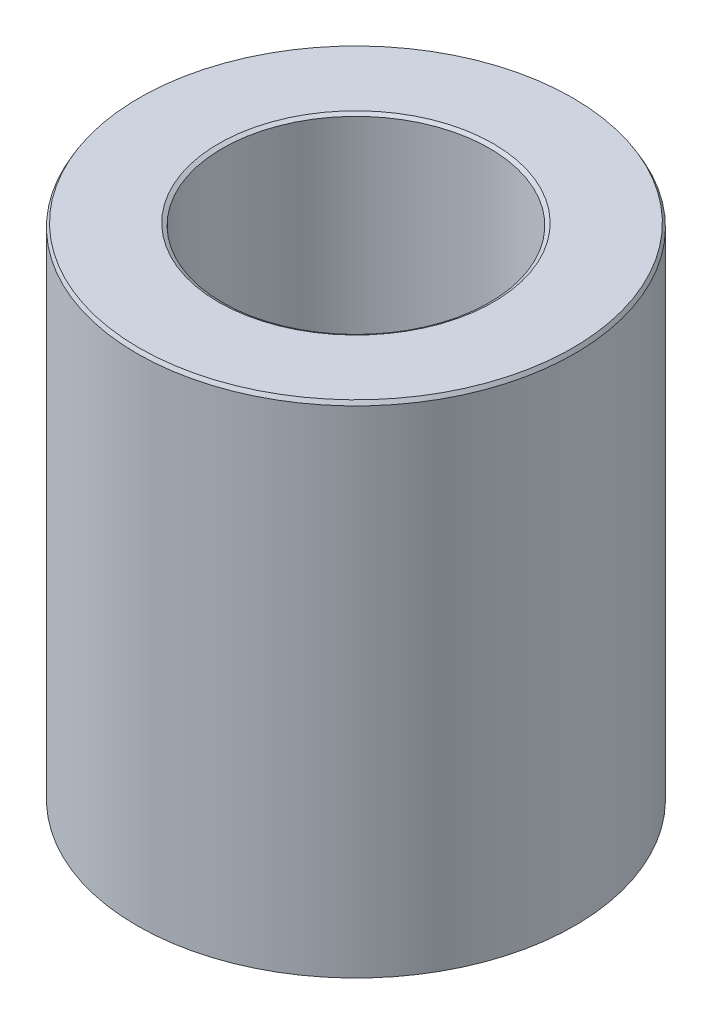
ISO-10303-21;
HEADER;
FILE_DESCRIPTION(('STEP AP214'),'2;1');
FILE_NAME('part.step','',(''),(''),'','','');
FILE_SCHEMA(('AUTOMOTIVE_DESIGN { 1 0 10303 214 1 1 1 1 }'));
ENDSEC;
DATA;
#1=APPLICATION_CONTEXT('core data for automotive mechanical design processes');
#2=APPLICATION_PROTOCOL_DEFINITION('international standard','automotive_design',2000,#1);
#3=PRODUCT_CONTEXT('',#1,'mechanical');
#4=PRODUCT('Part','Part','',(#3));
#5=PRODUCT_RELATED_PRODUCT_CATEGORY('part','',(#4));
#6=PRODUCT_DEFINITION_FORMATION('','',#4);
#7=PRODUCT_DEFINITION_CONTEXT('part definition',#1,'design');
#8=PRODUCT_DEFINITION('design','',#6,#7);
#9=PRODUCT_DEFINITION_SHAPE('','',#8);
#10=(LENGTH_UNIT() NAMED_UNIT(*) SI_UNIT(.MILLI.,.METRE.));
#11=(NAMED_UNIT(*) PLANE_ANGLE_UNIT() SI_UNIT($,.RADIAN.));
#12=(NAMED_UNIT(*) SI_UNIT($,.STERADIAN.) SOLID_ANGLE_UNIT());
#13=UNCERTAINTY_MEASURE_WITH_UNIT(LENGTH_MEASURE(1.E-05),#10,'distance_accuracy_value','');
#14=(GEOMETRIC_REPRESENTATION_CONTEXT(3) GLOBAL_UNCERTAINTY_ASSIGNED_CONTEXT((#13)) GLOBAL_UNIT_ASSIGNED_CONTEXT((#10,
#11,#12)) REPRESENTATION_CONTEXT('',''));
#15=CARTESIAN_POINT('',(0.,0.,0.));
#16=DIRECTION('',(0.,0.,1.));
#17=DIRECTION('',(1.,0.,0.));
#18=AXIS2_PLACEMENT_3D('',#15,#16,#17);
#19=CARTESIAN_POINT('',(0.,97.3660844483418,0.));
#20=DIRECTION('',(0.,-1.,0.));
#21=DIRECTION('',(0.,0.,-1.));
#22=AXIS2_PLACEMENT_3D('',#19,#20,#21);
#23=CYLINDRICAL_SURFACE('',#22,42.5);
#24=CARTESIAN_POINT('',(0.,0.422022249944531,0.));
#25=DIRECTION('',(0.,1.,0.));
#26=DIRECTION('',(0.,0.,1.));
#27=AXIS2_PLACEMENT_3D('',#24,#25,#26);
#28=CIRCLE('',#27,42.5);
#29=CARTESIAN_POINT('',(0.,0.422022249944531,42.5));
#30=VERTEX_POINT('',#29);
#31=EDGE_CURVE('E10',#30,#30,#28,.T.);
#32=ORIENTED_EDGE('',*,*,#31,.T.);
#33=EDGE_LOOP('',(#32));
#34=FACE_BOUND('',#33,.T.);
#35=CARTESIAN_POINT('',(0.,96.6351204695134,0.));
#36=DIRECTION('',(0.,1.,0.));
#37=DIRECTION('',(0.,0.,1.));
#38=AXIS2_PLACEMENT_3D('',#35,#36,#37);
#39=CIRCLE('',#38,42.5);
#40=CARTESIAN_POINT('',(0.,96.6351204695134,42.5));
#41=VERTEX_POINT('',#40);
#42=EDGE_CURVE('E50',#41,#41,#39,.F.);
#43=ORIENTED_EDGE('',*,*,#42,.T.);
#44=EDGE_LOOP('',(#43));
#45=FACE_BOUND('',#44,.T.);
#46=ADVANCED_FACE('F39',(#34,#45),#23,.T.);
#47=CARTESIAN_POINT('',(0.,97.3660844483418,0.));
#48=DIRECTION('',(0.,1.,0.));
#49=DIRECTION('',(0.,0.,1.));
#50=AXIS2_PLACEMENT_3D('',#47,#48,#49);
#51=PLANE('',#50);
#52=CARTESIAN_POINT('',(0.,97.3660844483418,0.));
#53=DIRECTION('',(0.,1.,0.));
#54=DIRECTION('',(0.,0.,1.));
#55=AXIS2_PLACEMENT_3D('',#52,#53,#54);
#56=CIRCLE('',#55,26.6689753907252);
#57=CARTESIAN_POINT('',(0.,97.3660844483418,26.6689753907252));
#58=VERTEX_POINT('',#57);
#59=EDGE_CURVE('E58',#58,#58,#56,.F.);
#60=ORIENTED_EDGE('',*,*,#59,.T.);
#61=EDGE_LOOP('',(#60));
#62=FACE_BOUND('',#61,.T.);
#63=CARTESIAN_POINT('',(0.,97.3660844483418,0.));
#64=DIRECTION('',(0.,1.,0.));
#65=DIRECTION('',(0.,0.,1.));
#66=AXIS2_PLACEMENT_3D('',#63,#64,#65);
#67=CIRCLE('',#66,42.0779777500555);
#68=CARTESIAN_POINT('',(0.,97.3660844483418,42.0779777500555));
#69=VERTEX_POINT('',#68);
#70=EDGE_CURVE('E61',#69,#69,#67,.T.);
#71=ORIENTED_EDGE('',*,*,#70,.T.);
#72=EDGE_LOOP('',(#71));
#73=FACE_BOUND('',#72,.T.);
#74=ADVANCED_FACE('F88',(#62,#73),#51,.T.);
#75=CARTESIAN_POINT('',(0.,0.,0.));
#76=DIRECTION('',(0.,1.,0.));
#77=DIRECTION('',(0.,0.,1.));
#78=AXIS2_PLACEMENT_3D('',#75,#76,#77);
#79=PLANE('',#78);
#80=CARTESIAN_POINT('',(0.,0.,0.));
#81=DIRECTION('',(0.,1.,0.));
#82=DIRECTION('',(0.,0.,1.));
#83=AXIS2_PLACEMENT_3D('',#80,#81,#82);
#84=CIRCLE('',#83,26.3600336618413);
#85=CARTESIAN_POINT('',(0.,0.,26.3600336618413));
#86=VERTEX_POINT('',#85);
#87=EDGE_CURVE('E51',#86,#86,#84,.T.);
#88=ORIENTED_EDGE('',*,*,#87,.T.);
#89=EDGE_LOOP('',(#88));
#90=FACE_BOUND('',#89,.T.);
#91=CARTESIAN_POINT('',(0.,0.,0.));
#92=DIRECTION('',(0.,1.,0.));
#93=DIRECTION('',(0.,0.,1.));
#94=AXIS2_PLACEMENT_3D('',#91,#92,#93);
#95=CIRCLE('',#94,41.7690360211715);
#96=CARTESIAN_POINT('',(0.,0.,41.7690360211715));
#97=VERTEX_POINT('',#96);
#98=EDGE_CURVE('E54',#97,#97,#95,.F.);
#99=ORIENTED_EDGE('',*,*,#98,.T.);
#100=EDGE_LOOP('',(#99));
#101=FACE_BOUND('',#100,.T.);
#102=ADVANCED_FACE('F83',(#90,#101),#79,.F.);
#103=CARTESIAN_POINT('',(0.,97.3660844483418,0.));
#104=DIRECTION('',(0.,-1.,0.));
#105=DIRECTION('',(0.,0.,-1.));
#106=AXIS2_PLACEMENT_3D('',#103,#104,#105);
#107=CYLINDRICAL_SURFACE('',#106,25.9380114118968);
#108=CARTESIAN_POINT('',(0.,96.9440621983973,0.));
#109=DIRECTION('',(0.,1.,0.));
#110=DIRECTION('',(0.,0.,1.));
#111=AXIS2_PLACEMENT_3D('',#108,#109,#110);
#112=CIRCLE('',#111,25.9380114118968);
#113=CARTESIAN_POINT('',(0.,96.9440621983973,25.9380114118968));
#114=VERTEX_POINT('',#113);
#115=EDGE_CURVE('E67',#114,#114,#112,.T.);
#116=ORIENTED_EDGE('',*,*,#115,.T.);
#117=EDGE_LOOP('',(#116));
#118=FACE_BOUND('',#117,.T.);
#119=CARTESIAN_POINT('',(0.,0.73096397882845,0.));
#120=DIRECTION('',(0.,1.,0.));
#121=DIRECTION('',(0.,0.,1.));
#122=AXIS2_PLACEMENT_3D('',#119,#120,#121);
#123=CIRCLE('',#122,25.9380114118968);
#124=CARTESIAN_POINT('',(0.,0.73096397882845,25.9380114118968));
#125=VERTEX_POINT('',#124);
#126=EDGE_CURVE('E69',#125,#125,#123,.F.);
#127=ORIENTED_EDGE('',*,*,#126,.T.);
#128=EDGE_LOOP('',(#127));
#129=FACE_BOUND('',#128,.T.);
#130=ADVANCED_FACE('F71',(#118,#129),#107,.F.);
#131=CARTESIAN_POINT('',(0.,96.9440621983973,0.));
#132=DIRECTION('',(0.,1.,0.));
#133=DIRECTION('',(0.,0.,1.));
#134=AXIS2_PLACEMENT_3D('',#131,#132,#133);
#135=CONICAL_SURFACE('',#134,25.9380114118968,1.04719755119659);
#136=ORIENTED_EDGE('',*,*,#59,.F.);
#137=EDGE_LOOP('',(#136));
#138=FACE_BOUND('',#137,.T.);
#139=ORIENTED_EDGE('',*,*,#115,.F.);
#140=EDGE_LOOP('',(#139));
#141=FACE_BOUND('',#140,.T.);
#142=ADVANCED_FACE('F77',(#138,#141),#135,.F.);
#143=CARTESIAN_POINT('',(0.,0.,0.));
#144=DIRECTION('',(0.,-1.,0.));
#145=DIRECTION('',(0.,0.,-1.));
#146=AXIS2_PLACEMENT_3D('',#143,#144,#145);
#147=CONICAL_SURFACE('',#146,26.3600336618413,0.523598775598294);
#148=ORIENTED_EDGE('',*,*,#126,.F.);
#149=EDGE_LOOP('',(#148));
#150=FACE_BOUND('',#149,.T.);
#151=ORIENTED_EDGE('',*,*,#87,.F.);
#152=EDGE_LOOP('',(#151));
#153=FACE_BOUND('',#152,.T.);
#154=ADVANCED_FACE('F73',(#150,#153),#147,.F.);
#155=CARTESIAN_POINT('',(0.,0.422022249944531,0.));
#156=DIRECTION('',(0.,1.,0.));
#157=DIRECTION('',(0.,0.,1.));
#158=AXIS2_PLACEMENT_3D('',#155,#156,#157);
#159=CONICAL_SURFACE('',#158,42.5,1.04719755119661);
#160=CARTESIAN_POINT('',(0.,0.,41.7690360211715));
#161=CARTESIAN_POINT('',(0.,0.00439606510358813,41.7766502292843));
#162=CARTESIAN_POINT('',(0.,0.00879213020717734,41.7842644373971));
#163=CARTESIAN_POINT('',(0.,0.0175842604143558,41.7994928536227));
#164=CARTESIAN_POINT('',(0.,0.021980325517945,41.8071070617355));
#165=CARTESIAN_POINT('',(0.,0.0307724557251223,41.8223354779611));
#166=CARTESIAN_POINT('',(0.,0.0351685208287105,41.8299496860739));
#167=CARTESIAN_POINT('',(0.,0.043960651035888,41.8451781022995));
#168=CARTESIAN_POINT('',(0.,0.0483567161394773,41.8527923104123));
#169=CARTESIAN_POINT('',(0.,0.0571488463466554,41.8680207266379));
#170=CARTESIAN_POINT('',(0.,0.0615449114502441,41.8756349347507));
#171=CARTESIAN_POINT('',(0.,0.0703370416574218,41.8908633509763));
#172=CARTESIAN_POINT('',(0.,0.0747331067610107,41.8984775590891));
#173=CARTESIAN_POINT('',(0.,0.0835252369681884,41.9137059753147));
#174=CARTESIAN_POINT('',(0.,0.0879213020717771,41.9213201834275));
#175=CARTESIAN_POINT('',(0.,0.0967134322789552,41.9365485996531));
#176=CARTESIAN_POINT('',(0.,0.101109497382545,41.9441628077659));
#177=CARTESIAN_POINT('',(0.,0.109901627589722,41.9593912239914));
#178=CARTESIAN_POINT('',(0.,0.11429769269331,41.9670054321042));
#179=CARTESIAN_POINT('',(0.,0.123089822900488,41.9822338483298));
#180=CARTESIAN_POINT('',(0.,0.127485888004077,41.9898480564426));
#181=CARTESIAN_POINT('',(0.,0.136278018211255,42.0050764726682));
#182=CARTESIAN_POINT('',(0.,0.140674083314844,42.012690680781));
#183=CARTESIAN_POINT('',(0.,0.149466213522021,42.0279190970066));
#184=CARTESIAN_POINT('',(0.,0.15386227862561,42.0355333051194));
#185=CARTESIAN_POINT('',(0.,0.162654408832788,42.050761721345));
#186=CARTESIAN_POINT('',(0.,0.167050473936378,42.0583759294578));
#187=CARTESIAN_POINT('',(0.,0.175842604143555,42.0736043456834));
#188=CARTESIAN_POINT('',(0.,0.180238669247143,42.0812185537962));
#189=CARTESIAN_POINT('',(0.,0.189030799454321,42.0964469700218));
#190=CARTESIAN_POINT('',(0.,0.19342686455791,42.1040611781346));
#191=CARTESIAN_POINT('',(0.,0.202218994765088,42.1192895943602));
#192=CARTESIAN_POINT('',(0.,0.206615059868677,42.126903802473));
#193=CARTESIAN_POINT('',(0.,0.215407190075854,42.1421322186986));
#194=CARTESIAN_POINT('',(0.,0.219803255179443,42.1497464268114));
#195=CARTESIAN_POINT('',(0.,0.228595385386621,42.164974843037));
#196=CARTESIAN_POINT('',(0.,0.232991450490211,42.1725890511498));
#197=CARTESIAN_POINT('',(0.,0.241783580697388,42.1878174673753));
#198=CARTESIAN_POINT('',(0.,0.246179645800976,42.1954316754881));
#199=CARTESIAN_POINT('',(0.,0.254971776008154,42.2106600917137));
#200=CARTESIAN_POINT('',(0.,0.259367841111743,42.2182742998265));
#201=CARTESIAN_POINT('',(0.,0.268159971318921,42.2335027160521));
#202=CARTESIAN_POINT('',(0.,0.27255603642251,42.2411169241649));
#203=CARTESIAN_POINT('',(0.,0.281348166629688,42.2563453403905));
#204=CARTESIAN_POINT('',(0.,0.285744231733277,42.2639595485033));
#205=CARTESIAN_POINT('',(0.,0.294536361940454,42.2791879647289));
#206=CARTESIAN_POINT('',(0.,0.298932427044043,42.2868021728417));
#207=CARTESIAN_POINT('',(0.,0.307724557251221,42.3020305890673));
#208=CARTESIAN_POINT('',(0.,0.31212062235481,42.3096447971801));
#209=CARTESIAN_POINT('',(0.,0.320912752561988,42.3248732134057));
#210=CARTESIAN_POINT('',(0.,0.325308817665576,42.3324874215185));
#211=CARTESIAN_POINT('',(0.,0.334100947872753,42.3477158377441));
#212=CARTESIAN_POINT('',(0.,0.338497012976343,42.3553300458569));
#213=CARTESIAN_POINT('',(0.,0.347289143183521,42.3705584620825));
#214=CARTESIAN_POINT('',(0.,0.35168520828711,42.3781726701953));
#215=CARTESIAN_POINT('',(0.,0.360477338494287,42.3934010864209));
#216=CARTESIAN_POINT('',(0.,0.364873403597876,42.4010152945337));
#217=CARTESIAN_POINT('',(0.,0.373665533805054,42.4162437107592));
#218=CARTESIAN_POINT('',(0.,0.378061598908643,42.423857918872));
#219=CARTESIAN_POINT('',(0.,0.386853729115821,42.4390863350976));
#220=CARTESIAN_POINT('',(0.,0.391249794219409,42.4467005432104));
#221=CARTESIAN_POINT('',(0.,0.400041924426586,42.461928959436));
#222=CARTESIAN_POINT('',(0.,0.404437989530176,42.4695431675488));
#223=CARTESIAN_POINT('',(0.,0.413230119737354,42.4847715837744));
#224=CARTESIAN_POINT('',(0.,0.417626184840943,42.4923857918872));
#225=CARTESIAN_POINT('',(0.,0.422022249944531,42.5));
#226=B_SPLINE_CURVE_WITH_KNOTS('',3,(#160,#161,#162,#163,#164,#165,#166,#167,#168,#169,#170,
#171,#172,#173,#174,#175,#176,#177,#178,#179,#180,#181,#182,#183,#184,#185,#186,#187,#188,#189,
#190,#191,#192,#193,#194,#195,#196,#197,#198,#199,#200,#201,#202,#203,#204,#205,#206,#207,#208,
#209,#210,#211,#212,#213,#214,#215,#216,#217,#218,#219,#220,#221,#222,#223,#224,#225),
.UNSPECIFIED.,.F.,.F.,(4,2,2,2,2,2,2,2,2,2,2,2,2,2,2,2,2,2,2,2,2,2,2,2,2,2,2,2,2,2,2,2,4),(0.,
0.0263763906215326,0.0527527812430651,0.0791291718646037,0.105505562486136,0.131881953107669,
0.158258343729201,0.184634734350734,0.211011124972267,0.237387515593805,0.263763906215338,
0.29014029683687,0.316516687458403,0.342893078079935,0.369269468701474,0.395645859323006,
0.422022249944539,0.448398640566072,0.474775031187604,0.501151421809143,0.527527812430675,
0.553904203052208,0.58028059367374,0.606656984295273,0.633033374916806,0.659409765538344,
0.685786156159877,0.712162546781409,0.738538937402942,0.764915328024474,0.791291718646013,
0.817668109267545,0.844044499889078),.UNSPECIFIED.);
#227=EDGE_CURVE('BSEAM76',#97,#30,#226,.T.);
#228=ORIENTED_EDGE('',*,*,#98,.F.);
#229=ORIENTED_EDGE('',*,*,#31,.F.);
#230=ORIENTED_EDGE('',*,*,#227,.T.);
#231=ORIENTED_EDGE('',*,*,#227,.F.);
#232=EDGE_LOOP('',(#228,#230,#229,#231));
#233=FACE_BOUND('',#232,.T.);
#234=ADVANCED_FACE('F76',(#233),#159,.T.);
#235=CARTESIAN_POINT('',(0.,97.3660844483418,0.));
#236=DIRECTION('',(0.,-1.,0.));
#237=DIRECTION('',(0.,0.,-1.));
#238=AXIS2_PLACEMENT_3D('',#235,#236,#237);
#239=CONICAL_SURFACE('',#238,42.0779777500555,0.523598775598305);
#240=ORIENTED_EDGE('',*,*,#42,.F.);
#241=EDGE_LOOP('',(#240));
#242=FACE_BOUND('',#241,.T.);
#243=ORIENTED_EDGE('',*,*,#70,.F.);
#244=EDGE_LOOP('',(#243));
#245=FACE_BOUND('',#244,.T.);
#246=ADVANCED_FACE('F45',(#242,#245),#239,.T.);
#247=CLOSED_SHELL('',(#46,#74,#102,#130,#142,#154,#234,#246));
#248=MANIFOLD_SOLID_BREP('B2',#247);
#249=ADVANCED_BREP_SHAPE_REPRESENTATION('',(#18,#248),#14);
#250=SHAPE_DEFINITION_REPRESENTATION(#9,#249);
ENDSEC;
END-ISO-10303-21;
